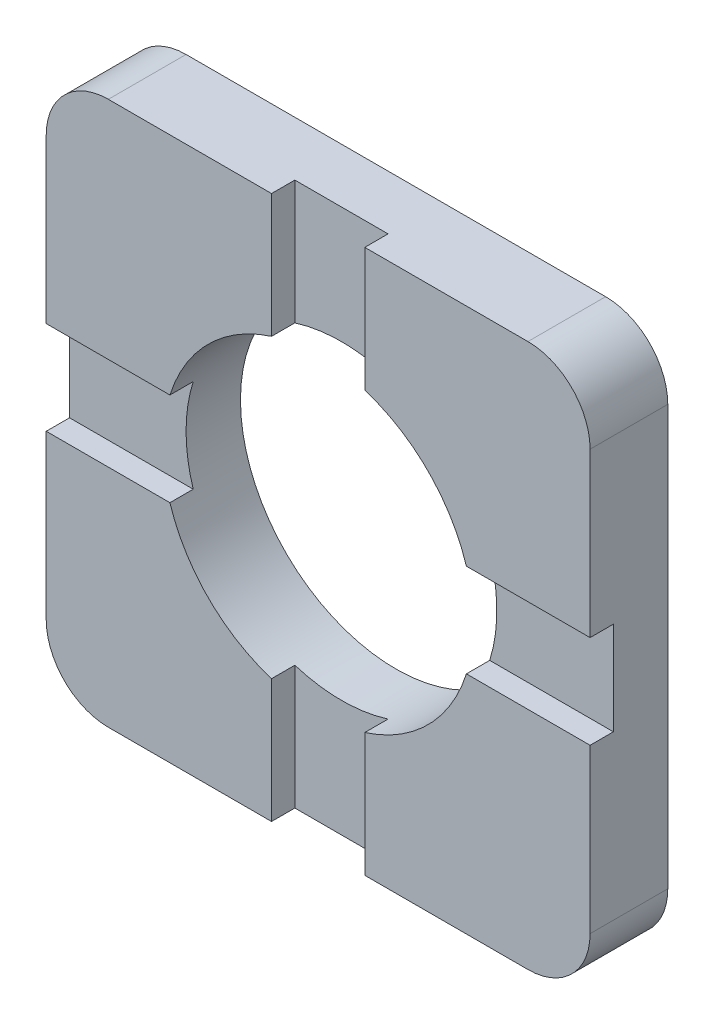
ISO-10303-21;
HEADER;
FILE_DESCRIPTION(('STEP AP214'),'2;1');
FILE_NAME('part.step','',(''),(''),'','','');
FILE_SCHEMA(('AUTOMOTIVE_DESIGN { 1 0 10303 214 1 1 1 1 }'));
ENDSEC;
DATA;
#1=APPLICATION_CONTEXT('core data for automotive mechanical design processes');
#2=APPLICATION_PROTOCOL_DEFINITION('international standard','automotive_design',2000,#1);
#3=PRODUCT_CONTEXT('',#1,'mechanical');
#4=PRODUCT('Part','Part','',(#3));
#5=PRODUCT_RELATED_PRODUCT_CATEGORY('part','',(#4));
#6=PRODUCT_DEFINITION_FORMATION('','',#4);
#7=PRODUCT_DEFINITION_CONTEXT('part definition',#1,'design');
#8=PRODUCT_DEFINITION('design','',#6,#7);
#9=PRODUCT_DEFINITION_SHAPE('','',#8);
#10=(LENGTH_UNIT() NAMED_UNIT(*) SI_UNIT(.MILLI.,.METRE.));
#11=(NAMED_UNIT(*) PLANE_ANGLE_UNIT() SI_UNIT($,.RADIAN.));
#12=(NAMED_UNIT(*) SI_UNIT($,.STERADIAN.) SOLID_ANGLE_UNIT());
#13=UNCERTAINTY_MEASURE_WITH_UNIT(LENGTH_MEASURE(1.E-05),#10,'distance_accuracy_value','');
#14=(GEOMETRIC_REPRESENTATION_CONTEXT(3) GLOBAL_UNCERTAINTY_ASSIGNED_CONTEXT((#13)) GLOBAL_UNIT_ASSIGNED_CONTEXT((#10,
#11,#12)) REPRESENTATION_CONTEXT('',''));
#15=CARTESIAN_POINT('',(0.,0.,0.));
#16=DIRECTION('',(0.,0.,1.));
#17=DIRECTION('',(1.,0.,0.));
#18=AXIS2_PLACEMENT_3D('',#15,#16,#17);
#19=CARTESIAN_POINT('',(0.,0.6,0.7));
#20=DIRECTION('',(0.,1.,0.));
#21=DIRECTION('',(0.,0.,1.));
#22=AXIS2_PLACEMENT_3D('',#19,#20,#21);
#23=PLANE('',#22);
#24=DIRECTION('',(0.,0.,1.));
#25=VECTOR('',#24,1.);
#26=CARTESIAN_POINT('',(-3.5,0.6,0.7));
#27=LINE('',#26,#25);
#28=CARTESIAN_POINT('',(-3.5,0.6,0.7));
#29=VERTEX_POINT('',#28);
#30=CARTESIAN_POINT('',(-3.5,0.6,1.));
#31=VERTEX_POINT('',#30);
#32=EDGE_CURVE('E236',#29,#31,#27,.T.);
#33=ORIENTED_EDGE('',*,*,#32,.F.);
#34=DIRECTION('',(1.,0.,0.));
#35=VECTOR('',#34,1.);
#36=CARTESIAN_POINT('',(0.,0.6,0.7));
#37=LINE('',#36,#35);
#38=CARTESIAN_POINT('',(-1.9078784028339,0.6,0.7));
#39=VERTEX_POINT('',#38);
#40=EDGE_CURVE('E301',#39,#29,#37,.F.);
#41=ORIENTED_EDGE('',*,*,#40,.F.);
#42=DIRECTION('',(0.,0.,1.));
#43=VECTOR('',#42,1.);
#44=CARTESIAN_POINT('',(-1.9078784028339,0.6,0.7));
#45=LINE('',#44,#43);
#46=CARTESIAN_POINT('',(-1.9078784028339,0.6,1.));
#47=VERTEX_POINT('',#46);
#48=EDGE_CURVE('E243',#47,#39,#45,.F.);
#49=ORIENTED_EDGE('',*,*,#48,.F.);
#50=DIRECTION('',(1.,0.,0.));
#51=VECTOR('',#50,1.);
#52=CARTESIAN_POINT('',(-2.7,0.6,1.));
#53=LINE('',#52,#51);
#54=EDGE_CURVE('E351',#31,#47,#53,.T.);
#55=ORIENTED_EDGE('',*,*,#54,.F.);
#56=EDGE_LOOP('',(#33,#41,#49,#55));
#57=FACE_BOUND('',#56,.T.);
#58=ADVANCED_FACE('F17',(#57),#23,.F.);
#59=CARTESIAN_POINT('',(-0.6,0.,0.7));
#60=DIRECTION('',(1.,0.,0.));
#61=DIRECTION('',(0.,0.,-1.));
#62=AXIS2_PLACEMENT_3D('',#59,#60,#61);
#63=PLANE('',#62);
#64=DIRECTION('',(0.,1.,0.));
#65=VECTOR('',#64,1.);
#66=CARTESIAN_POINT('',(-0.6,0.,0.7));
#67=LINE('',#66,#65);
#68=CARTESIAN_POINT('',(-0.6,3.5,0.7));
#69=VERTEX_POINT('',#68);
#70=CARTESIAN_POINT('',(-0.6,1.90787840283389,0.7));
#71=VERTEX_POINT('',#70);
#72=EDGE_CURVE('E356',#69,#71,#67,.F.);
#73=ORIENTED_EDGE('',*,*,#72,.F.);
#74=DIRECTION('',(0.,0.,-1.));
#75=VECTOR('',#74,1.);
#76=CARTESIAN_POINT('',(-0.6,3.5,0.7));
#77=LINE('',#76,#75);
#78=CARTESIAN_POINT('',(-0.6,3.5,1.));
#79=VERTEX_POINT('',#78);
#80=EDGE_CURVE('E224',#69,#79,#77,.F.);
#81=ORIENTED_EDGE('',*,*,#80,.T.);
#82=DIRECTION('',(0.,1.,0.));
#83=VECTOR('',#82,1.);
#84=CARTESIAN_POINT('',(-0.6,-2.7,1.));
#85=LINE('',#84,#83);
#86=CARTESIAN_POINT('',(-0.6,1.90787840283389,1.));
#87=VERTEX_POINT('',#86);
#88=EDGE_CURVE('E337',#87,#79,#85,.T.);
#89=ORIENTED_EDGE('',*,*,#88,.F.);
#90=DIRECTION('',(0.,0.,-1.));
#91=VECTOR('',#90,1.);
#92=CARTESIAN_POINT('',(-0.6,1.90787840283389,0.7));
#93=LINE('',#92,#91);
#94=EDGE_CURVE('E234',#87,#71,#93,.T.);
#95=ORIENTED_EDGE('',*,*,#94,.T.);
#96=EDGE_LOOP('',(#73,#81,#89,#95));
#97=FACE_BOUND('',#96,.T.);
#98=ADVANCED_FACE('F681',(#97),#63,.T.);
#99=CARTESIAN_POINT('',(0.,0.6,0.7));
#100=DIRECTION('',(0.,1.,0.));
#101=DIRECTION('',(0.,0.,1.));
#102=AXIS2_PLACEMENT_3D('',#99,#100,#101);
#103=PLANE('',#102);
#104=DIRECTION('',(0.,0.,1.));
#105=VECTOR('',#104,1.);
#106=CARTESIAN_POINT('',(1.90787840283389,0.6,0.7));
#107=LINE('',#106,#105);
#108=CARTESIAN_POINT('',(1.90787840283389,0.6,0.7));
#109=VERTEX_POINT('',#108);
#110=CARTESIAN_POINT('',(1.90787840283389,0.6,1.));
#111=VERTEX_POINT('',#110);
#112=EDGE_CURVE('E147',#109,#111,#107,.T.);
#113=ORIENTED_EDGE('',*,*,#112,.F.);
#114=DIRECTION('',(1.,0.,0.));
#115=VECTOR('',#114,1.);
#116=CARTESIAN_POINT('',(0.,0.6,0.7));
#117=LINE('',#116,#115);
#118=CARTESIAN_POINT('',(3.5,0.6,0.7));
#119=VERTEX_POINT('',#118);
#120=EDGE_CURVE('E153',#119,#109,#117,.F.);
#121=ORIENTED_EDGE('',*,*,#120,.F.);
#122=DIRECTION('',(0.,0.,1.));
#123=VECTOR('',#122,1.);
#124=CARTESIAN_POINT('',(3.5,0.6,0.7));
#125=LINE('',#124,#123);
#126=CARTESIAN_POINT('',(3.5,0.6,1.));
#127=VERTEX_POINT('',#126);
#128=EDGE_CURVE('E164',#127,#119,#125,.F.);
#129=ORIENTED_EDGE('',*,*,#128,.F.);
#130=DIRECTION('',(1.,0.,0.));
#131=VECTOR('',#130,1.);
#132=CARTESIAN_POINT('',(-2.7,0.6,1.));
#133=LINE('',#132,#131);
#134=EDGE_CURVE('E161',#111,#127,#133,.T.);
#135=ORIENTED_EDGE('',*,*,#134,.F.);
#136=EDGE_LOOP('',(#113,#121,#129,#135));
#137=FACE_BOUND('',#136,.T.);
#138=ADVANCED_FACE('F156',(#137),#103,.F.);
#139=CARTESIAN_POINT('',(0.6,0.,0.7));
#140=DIRECTION('',(1.,0.,0.));
#141=DIRECTION('',(0.,0.,-1.));
#142=AXIS2_PLACEMENT_3D('',#139,#140,#141);
#143=PLANE('',#142);
#144=DIRECTION('',(0.,0.,-1.));
#145=VECTOR('',#144,1.);
#146=CARTESIAN_POINT('',(0.6,3.5,0.7));
#147=LINE('',#146,#145);
#148=CARTESIAN_POINT('',(0.6,3.5,0.7));
#149=VERTEX_POINT('',#148);
#150=CARTESIAN_POINT('',(0.6,3.5,1.));
#151=VERTEX_POINT('',#150);
#152=EDGE_CURVE('E213',#149,#151,#147,.F.);
#153=ORIENTED_EDGE('',*,*,#152,.F.);
#154=DIRECTION('',(0.,1.,0.));
#155=VECTOR('',#154,1.);
#156=CARTESIAN_POINT('',(0.6,0.,0.7));
#157=LINE('',#156,#155);
#158=CARTESIAN_POINT('',(0.6,1.90787840283389,0.7));
#159=VERTEX_POINT('',#158);
#160=EDGE_CURVE('E361',#159,#149,#157,.T.);
#161=ORIENTED_EDGE('',*,*,#160,.F.);
#162=DIRECTION('',(0.,0.,-1.));
#163=VECTOR('',#162,1.);
#164=CARTESIAN_POINT('',(0.6,1.90787840283389,0.7));
#165=LINE('',#164,#163);
#166=CARTESIAN_POINT('',(0.6,1.90787840283389,1.));
#167=VERTEX_POINT('',#166);
#168=EDGE_CURVE('E163',#167,#159,#165,.T.);
#169=ORIENTED_EDGE('',*,*,#168,.F.);
#170=DIRECTION('',(0.,1.,0.));
#171=VECTOR('',#170,1.);
#172=CARTESIAN_POINT('',(0.6,-2.7,1.));
#173=LINE('',#172,#171);
#174=EDGE_CURVE('E369',#151,#167,#173,.F.);
#175=ORIENTED_EDGE('',*,*,#174,.F.);
#176=EDGE_LOOP('',(#153,#161,#169,#175));
#177=FACE_BOUND('',#176,.T.);
#178=ADVANCED_FACE('F662',(#177),#143,.F.);
#179=CARTESIAN_POINT('',(0.,-0.6,0.7));
#180=DIRECTION('',(0.,1.,0.));
#181=DIRECTION('',(0.,0.,1.));
#182=AXIS2_PLACEMENT_3D('',#179,#180,#181);
#183=PLANE('',#182);
#184=DIRECTION('',(1.,0.,0.));
#185=VECTOR('',#184,1.);
#186=CARTESIAN_POINT('',(0.,-0.6,0.7));
#187=LINE('',#186,#185);
#188=CARTESIAN_POINT('',(1.90787840283389,-0.6,0.7));
#189=VERTEX_POINT('',#188);
#190=CARTESIAN_POINT('',(3.5,-0.6,0.7));
#191=VERTEX_POINT('',#190);
#192=EDGE_CURVE('E152',#189,#191,#187,.T.);
#193=ORIENTED_EDGE('',*,*,#192,.F.);
#194=DIRECTION('',(0.,0.,1.));
#195=VECTOR('',#194,1.);
#196=CARTESIAN_POINT('',(1.90787840283389,-0.6,0.7));
#197=LINE('',#196,#195);
#198=CARTESIAN_POINT('',(1.90787840283389,-0.6,1.));
#199=VERTEX_POINT('',#198);
#200=EDGE_CURVE('E150',#189,#199,#197,.T.);
#201=ORIENTED_EDGE('',*,*,#200,.T.);
#202=DIRECTION('',(1.,0.,0.));
#203=VECTOR('',#202,1.);
#204=CARTESIAN_POINT('',(-2.7,-0.6,1.));
#205=LINE('',#204,#203);
#206=CARTESIAN_POINT('',(3.5,-0.6,1.));
#207=VERTEX_POINT('',#206);
#208=EDGE_CURVE('E374',#207,#199,#205,.F.);
#209=ORIENTED_EDGE('',*,*,#208,.F.);
#210=DIRECTION('',(0.,0.,1.));
#211=VECTOR('',#210,1.);
#212=CARTESIAN_POINT('',(3.5,-0.6,0.7));
#213=LINE('',#212,#211);
#214=EDGE_CURVE('E210',#207,#191,#213,.F.);
#215=ORIENTED_EDGE('',*,*,#214,.T.);
#216=EDGE_LOOP('',(#193,#201,#209,#215));
#217=FACE_BOUND('',#216,.T.);
#218=ADVANCED_FACE('F652',(#217),#183,.T.);
#219=CARTESIAN_POINT('',(0.6,0.,0.7));
#220=DIRECTION('',(1.,0.,0.));
#221=DIRECTION('',(0.,0.,-1.));
#222=AXIS2_PLACEMENT_3D('',#219,#220,#221);
#223=PLANE('',#222);
#224=DIRECTION('',(0.,0.,-1.));
#225=VECTOR('',#224,1.);
#226=CARTESIAN_POINT('',(0.6,-1.90787840283389,0.7));
#227=LINE('',#226,#225);
#228=CARTESIAN_POINT('',(0.6,-1.90787840283389,0.7));
#229=VERTEX_POINT('',#228);
#230=CARTESIAN_POINT('',(0.6,-1.90787840283389,1.));
#231=VERTEX_POINT('',#230);
#232=EDGE_CURVE('E195',#229,#231,#227,.F.);
#233=ORIENTED_EDGE('',*,*,#232,.F.);
#234=DIRECTION('',(0.,1.,0.));
#235=VECTOR('',#234,1.);
#236=CARTESIAN_POINT('',(0.6,0.,0.7));
#237=LINE('',#236,#235);
#238=CARTESIAN_POINT('',(0.6,-3.5,0.7));
#239=VERTEX_POINT('',#238);
#240=EDGE_CURVE('E389',#239,#229,#237,.T.);
#241=ORIENTED_EDGE('',*,*,#240,.F.);
#242=DIRECTION('',(0.,0.,-1.));
#243=VECTOR('',#242,1.);
#244=CARTESIAN_POINT('',(0.6,-3.5,0.7));
#245=LINE('',#244,#243);
#246=CARTESIAN_POINT('',(0.6,-3.5,1.));
#247=VERTEX_POINT('',#246);
#248=EDGE_CURVE('E200',#247,#239,#245,.T.);
#249=ORIENTED_EDGE('',*,*,#248,.F.);
#250=DIRECTION('',(0.,1.,0.));
#251=VECTOR('',#250,1.);
#252=CARTESIAN_POINT('',(0.6,-2.7,1.));
#253=LINE('',#252,#251);
#254=EDGE_CURVE('E379',#231,#247,#253,.F.);
#255=ORIENTED_EDGE('',*,*,#254,.F.);
#256=EDGE_LOOP('',(#233,#241,#249,#255));
#257=FACE_BOUND('',#256,.T.);
#258=ADVANCED_FACE('F642',(#257),#223,.F.);
#259=CARTESIAN_POINT('',(-0.6,0.,0.7));
#260=DIRECTION('',(1.,0.,0.));
#261=DIRECTION('',(0.,0.,-1.));
#262=AXIS2_PLACEMENT_3D('',#259,#260,#261);
#263=PLANE('',#262);
#264=DIRECTION('',(0.,1.,0.));
#265=VECTOR('',#264,1.);
#266=CARTESIAN_POINT('',(-0.6,0.,0.7));
#267=LINE('',#266,#265);
#268=CARTESIAN_POINT('',(-0.6,-1.90787840283389,0.7));
#269=VERTEX_POINT('',#268);
#270=CARTESIAN_POINT('',(-0.6,-3.5,0.7));
#271=VERTEX_POINT('',#270);
#272=EDGE_CURVE('E384',#269,#271,#267,.F.);
#273=ORIENTED_EDGE('',*,*,#272,.F.);
#274=DIRECTION('',(0.,0.,-1.));
#275=VECTOR('',#274,1.);
#276=CARTESIAN_POINT('',(-0.6,-1.90787840283389,0.7));
#277=LINE('',#276,#275);
#278=CARTESIAN_POINT('',(-0.6,-1.90787840283389,1.));
#279=VERTEX_POINT('',#278);
#280=EDGE_CURVE('E188',#269,#279,#277,.F.);
#281=ORIENTED_EDGE('',*,*,#280,.T.);
#282=DIRECTION('',(0.,1.,0.));
#283=VECTOR('',#282,1.);
#284=CARTESIAN_POINT('',(-0.6,-2.7,1.));
#285=LINE('',#284,#283);
#286=CARTESIAN_POINT('',(-0.6,-3.5,1.));
#287=VERTEX_POINT('',#286);
#288=EDGE_CURVE('E394',#287,#279,#285,.T.);
#289=ORIENTED_EDGE('',*,*,#288,.F.);
#290=DIRECTION('',(0.,0.,-1.));
#291=VECTOR('',#290,1.);
#292=CARTESIAN_POINT('',(-0.6,-3.5,0.7));
#293=LINE('',#292,#291);
#294=EDGE_CURVE('E192',#287,#271,#293,.T.);
#295=ORIENTED_EDGE('',*,*,#294,.T.);
#296=EDGE_LOOP('',(#273,#281,#289,#295));
#297=FACE_BOUND('',#296,.T.);
#298=ADVANCED_FACE('F632',(#297),#263,.T.);
#299=CARTESIAN_POINT('',(0.,-0.6,0.7));
#300=DIRECTION('',(0.,1.,0.));
#301=DIRECTION('',(0.,0.,1.));
#302=AXIS2_PLACEMENT_3D('',#299,#300,#301);
#303=PLANE('',#302);
#304=DIRECTION('',(1.,0.,0.));
#305=VECTOR('',#304,1.);
#306=CARTESIAN_POINT('',(0.,-0.6,0.7));
#307=LINE('',#306,#305);
#308=CARTESIAN_POINT('',(-3.5,-0.6,0.7));
#309=VERTEX_POINT('',#308);
#310=CARTESIAN_POINT('',(-1.90787840283389,-0.6,0.7));
#311=VERTEX_POINT('',#310);
#312=EDGE_CURVE('E305',#309,#311,#307,.T.);
#313=ORIENTED_EDGE('',*,*,#312,.F.);
#314=DIRECTION('',(0.,0.,1.));
#315=VECTOR('',#314,1.);
#316=CARTESIAN_POINT('',(-3.5,-0.6,0.7));
#317=LINE('',#316,#315);
#318=CARTESIAN_POINT('',(-3.5,-0.6,1.));
#319=VERTEX_POINT('',#318);
#320=EDGE_CURVE('E169',#309,#319,#317,.T.);
#321=ORIENTED_EDGE('',*,*,#320,.T.);
#322=DIRECTION('',(1.,0.,0.));
#323=VECTOR('',#322,1.);
#324=CARTESIAN_POINT('',(-2.7,-0.6,1.));
#325=LINE('',#324,#323);
#326=CARTESIAN_POINT('',(-1.90787840283389,-0.6,1.));
#327=VERTEX_POINT('',#326);
#328=EDGE_CURVE('E207',#327,#319,#325,.F.);
#329=ORIENTED_EDGE('',*,*,#328,.F.);
#330=DIRECTION('',(0.,0.,1.));
#331=VECTOR('',#330,1.);
#332=CARTESIAN_POINT('',(-1.90787840283389,-0.6,0.7));
#333=LINE('',#332,#331);
#334=EDGE_CURVE('E172',#327,#311,#333,.F.);
#335=ORIENTED_EDGE('',*,*,#334,.T.);
#336=EDGE_LOOP('',(#313,#321,#329,#335));
#337=FACE_BOUND('',#336,.T.);
#338=ADVANCED_FACE('F623',(#337),#303,.T.);
#339=CARTESIAN_POINT('',(0.,0.,0.7));
#340=DIRECTION('',(0.,0.,1.));
#341=DIRECTION('',(1.,0.,0.));
#342=AXIS2_PLACEMENT_3D('',#339,#340,#341);
#343=PLANE('',#342);
#344=CARTESIAN_POINT('',(0.,0.,0.7));
#345=DIRECTION('',(0.,0.,-1.));
#346=DIRECTION('',(-1.,0.,0.));
#347=AXIS2_PLACEMENT_3D('',#344,#345,#346);
#348=CIRCLE('',#347,2.);
#349=EDGE_CURVE('E20',#109,#189,#348,.T.);
#350=ORIENTED_EDGE('',*,*,#349,.T.);
#351=ORIENTED_EDGE('',*,*,#192,.T.);
#352=DIRECTION('',(0.,-1.,0.));
#353=VECTOR('',#352,1.);
#354=CARTESIAN_POINT('',(3.5,2.7,0.7));
#355=LINE('',#354,#353);
#356=EDGE_CURVE('E168',#191,#119,#355,.F.);
#357=ORIENTED_EDGE('',*,*,#356,.T.);
#358=ORIENTED_EDGE('',*,*,#120,.T.);
#359=EDGE_LOOP('',(#350,#351,#357,#358));
#360=FACE_BOUND('',#359,.T.);
#361=ADVANCED_FACE('F166',(#360),#343,.T.);
#362=CARTESIAN_POINT('',(0.,0.,0.7));
#363=DIRECTION('',(0.,0.,1.));
#364=DIRECTION('',(1.,0.,0.));
#365=AXIS2_PLACEMENT_3D('',#362,#363,#364);
#366=PLANE('',#365);
#367=DIRECTION('',(0.,1.,0.));
#368=VECTOR('',#367,1.);
#369=CARTESIAN_POINT('',(-3.5,2.7,0.7));
#370=LINE('',#369,#368);
#371=EDGE_CURVE('E248',#29,#309,#370,.F.);
#372=ORIENTED_EDGE('',*,*,#371,.T.);
#373=ORIENTED_EDGE('',*,*,#312,.T.);
#374=CARTESIAN_POINT('',(0.,0.,0.7));
#375=DIRECTION('',(0.,0.,-1.));
#376=DIRECTION('',(-1.,0.,0.));
#377=AXIS2_PLACEMENT_3D('',#374,#375,#376);
#378=CIRCLE('',#377,2.);
#379=EDGE_CURVE('E300',#311,#39,#378,.T.);
#380=ORIENTED_EDGE('',*,*,#379,.T.);
#381=ORIENTED_EDGE('',*,*,#40,.T.);
#382=EDGE_LOOP('',(#372,#373,#380,#381));
#383=FACE_BOUND('',#382,.T.);
#384=ADVANCED_FACE('F605',(#383),#366,.T.);
#385=CARTESIAN_POINT('',(-2.7,-2.7,1.));
#386=DIRECTION('',(0.,0.,1.));
#387=DIRECTION('',(1.,0.,0.));
#388=AXIS2_PLACEMENT_3D('',#385,#386,#387);
#389=PLANE('',#388);
#390=DIRECTION('',(0.,1.,0.));
#391=VECTOR('',#390,1.);
#392=CARTESIAN_POINT('',(-3.5,2.7,1.));
#393=LINE('',#392,#391);
#394=CARTESIAN_POINT('',(-3.5,2.7,1.));
#395=VERTEX_POINT('',#394);
#396=EDGE_CURVE('E252',#395,#31,#393,.F.);
#397=ORIENTED_EDGE('',*,*,#396,.T.);
#398=ORIENTED_EDGE('',*,*,#54,.T.);
#399=CARTESIAN_POINT('',(0.,0.,1.));
#400=DIRECTION('',(0.,0.,-1.));
#401=DIRECTION('',(-1.,0.,0.));
#402=AXIS2_PLACEMENT_3D('',#399,#400,#401);
#403=CIRCLE('',#402,2.);
#404=EDGE_CURVE('E288',#47,#87,#403,.T.);
#405=ORIENTED_EDGE('',*,*,#404,.T.);
#406=ORIENTED_EDGE('',*,*,#88,.T.);
#407=DIRECTION('',(1.,0.,0.));
#408=VECTOR('',#407,1.);
#409=CARTESIAN_POINT('',(-2.7,3.5,1.));
#410=LINE('',#409,#408);
#411=CARTESIAN_POINT('',(-2.7,3.5,1.));
#412=VERTEX_POINT('',#411);
#413=EDGE_CURVE('E324',#79,#412,#410,.F.);
#414=ORIENTED_EDGE('',*,*,#413,.T.);
#415=CARTESIAN_POINT('',(-2.7,2.7,1.));
#416=DIRECTION('',(0.,0.,-1.));
#417=DIRECTION('',(-1.,0.,0.));
#418=AXIS2_PLACEMENT_3D('',#415,#416,#417);
#419=CIRCLE('',#418,0.8);
#420=EDGE_CURVE('E230',#395,#412,#419,.T.);
#421=ORIENTED_EDGE('',*,*,#420,.F.);
#422=EDGE_LOOP('',(#397,#398,#405,#406,#414,#421));
#423=FACE_BOUND('',#422,.T.);
#424=ADVANCED_FACE('F595',(#423),#389,.T.);
#425=CARTESIAN_POINT('',(0.,0.,0.7));
#426=DIRECTION('',(0.,0.,1.));
#427=DIRECTION('',(1.,0.,0.));
#428=AXIS2_PLACEMENT_3D('',#425,#426,#427);
#429=PLANE('',#428);
#430=ORIENTED_EDGE('',*,*,#160,.T.);
#431=DIRECTION('',(1.,0.,0.));
#432=VECTOR('',#431,1.);
#433=CARTESIAN_POINT('',(-2.7,3.5,0.7));
#434=LINE('',#433,#432);
#435=EDGE_CURVE('E227',#149,#69,#434,.F.);
#436=ORIENTED_EDGE('',*,*,#435,.T.);
#437=ORIENTED_EDGE('',*,*,#72,.T.);
#438=CARTESIAN_POINT('',(0.,0.,0.7));
#439=DIRECTION('',(0.,0.,-1.));
#440=DIRECTION('',(-1.,0.,0.));
#441=AXIS2_PLACEMENT_3D('',#438,#439,#440);
#442=CIRCLE('',#441,2.);
#443=EDGE_CURVE('E285',#71,#159,#442,.T.);
#444=ORIENTED_EDGE('',*,*,#443,.T.);
#445=EDGE_LOOP('',(#430,#436,#437,#444));
#446=FACE_BOUND('',#445,.T.);
#447=ADVANCED_FACE('F585',(#446),#429,.T.);
#448=CARTESIAN_POINT('',(-2.7,-2.7,1.));
#449=DIRECTION('',(0.,0.,1.));
#450=DIRECTION('',(1.,0.,0.));
#451=AXIS2_PLACEMENT_3D('',#448,#449,#450);
#452=PLANE('',#451);
#453=ORIENTED_EDGE('',*,*,#174,.T.);
#454=CARTESIAN_POINT('',(0.,0.,1.));
#455=DIRECTION('',(0.,0.,-1.));
#456=DIRECTION('',(-1.,0.,0.));
#457=AXIS2_PLACEMENT_3D('',#454,#455,#456);
#458=CIRCLE('',#457,2.);
#459=EDGE_CURVE('E283',#167,#111,#458,.T.);
#460=ORIENTED_EDGE('',*,*,#459,.T.);
#461=ORIENTED_EDGE('',*,*,#134,.T.);
#462=DIRECTION('',(0.,-1.,0.));
#463=VECTOR('',#462,1.);
#464=CARTESIAN_POINT('',(3.5,2.7,1.));
#465=LINE('',#464,#463);
#466=CARTESIAN_POINT('',(3.5,2.7,1.));
#467=VERTEX_POINT('',#466);
#468=EDGE_CURVE('E256',#127,#467,#465,.F.);
#469=ORIENTED_EDGE('',*,*,#468,.T.);
#470=CARTESIAN_POINT('',(2.7,2.7,1.));
#471=DIRECTION('',(0.,0.,-1.));
#472=DIRECTION('',(-1.,0.,0.));
#473=AXIS2_PLACEMENT_3D('',#470,#471,#472);
#474=CIRCLE('',#473,0.8);
#475=CARTESIAN_POINT('',(2.7,3.5,1.));
#476=VERTEX_POINT('',#475);
#477=EDGE_CURVE('E295',#476,#467,#474,.T.);
#478=ORIENTED_EDGE('',*,*,#477,.F.);
#479=DIRECTION('',(1.,0.,0.));
#480=VECTOR('',#479,1.);
#481=CARTESIAN_POINT('',(-2.7,3.5,1.));
#482=LINE('',#481,#480);
#483=EDGE_CURVE('E231',#476,#151,#482,.F.);
#484=ORIENTED_EDGE('',*,*,#483,.T.);
#485=EDGE_LOOP('',(#453,#460,#461,#469,#478,#484));
#486=FACE_BOUND('',#485,.T.);
#487=ADVANCED_FACE('F575',(#486),#452,.T.);
#488=CARTESIAN_POINT('',(-2.7,-2.7,1.));
#489=DIRECTION('',(0.,0.,1.));
#490=DIRECTION('',(1.,0.,0.));
#491=AXIS2_PLACEMENT_3D('',#488,#489,#490);
#492=PLANE('',#491);
#493=DIRECTION('',(-1.,0.,0.));
#494=VECTOR('',#493,1.);
#495=CARTESIAN_POINT('',(-2.7,-3.5,1.));
#496=LINE('',#495,#494);
#497=CARTESIAN_POINT('',(2.7,-3.5,1.));
#498=VERTEX_POINT('',#497);
#499=EDGE_CURVE('E180',#247,#498,#496,.F.);
#500=ORIENTED_EDGE('',*,*,#499,.T.);
#501=CARTESIAN_POINT('',(2.7,-2.7,1.));
#502=DIRECTION('',(0.,0.,-1.));
#503=DIRECTION('',(-1.,0.,0.));
#504=AXIS2_PLACEMENT_3D('',#501,#502,#503);
#505=CIRCLE('',#504,0.799999999999999);
#506=CARTESIAN_POINT('',(3.5,-2.7,1.));
#507=VERTEX_POINT('',#506);
#508=EDGE_CURVE('E299',#507,#498,#505,.T.);
#509=ORIENTED_EDGE('',*,*,#508,.F.);
#510=DIRECTION('',(0.,-1.,0.));
#511=VECTOR('',#510,1.);
#512=CARTESIAN_POINT('',(3.5,2.7,1.));
#513=LINE('',#512,#511);
#514=EDGE_CURVE('E298',#507,#207,#513,.F.);
#515=ORIENTED_EDGE('',*,*,#514,.T.);
#516=ORIENTED_EDGE('',*,*,#208,.T.);
#517=CARTESIAN_POINT('',(0.,0.,1.));
#518=DIRECTION('',(0.,0.,-1.));
#519=DIRECTION('',(-1.,0.,0.));
#520=AXIS2_PLACEMENT_3D('',#517,#518,#519);
#521=CIRCLE('',#520,2.);
#522=EDGE_CURVE('E280',#199,#231,#521,.T.);
#523=ORIENTED_EDGE('',*,*,#522,.T.);
#524=ORIENTED_EDGE('',*,*,#254,.T.);
#525=EDGE_LOOP('',(#500,#509,#515,#516,#523,#524));
#526=FACE_BOUND('',#525,.T.);
#527=ADVANCED_FACE('F565',(#526),#492,.T.);
#528=CARTESIAN_POINT('',(0.,0.,0.7));
#529=DIRECTION('',(0.,0.,1.));
#530=DIRECTION('',(1.,0.,0.));
#531=AXIS2_PLACEMENT_3D('',#528,#529,#530);
#532=PLANE('',#531);
#533=ORIENTED_EDGE('',*,*,#240,.T.);
#534=CARTESIAN_POINT('',(0.,0.,0.7));
#535=DIRECTION('',(0.,0.,-1.));
#536=DIRECTION('',(-1.,0.,0.));
#537=AXIS2_PLACEMENT_3D('',#534,#535,#536);
#538=CIRCLE('',#537,2.);
#539=EDGE_CURVE('E277',#229,#269,#538,.T.);
#540=ORIENTED_EDGE('',*,*,#539,.T.);
#541=ORIENTED_EDGE('',*,*,#272,.T.);
#542=DIRECTION('',(-1.,0.,0.));
#543=VECTOR('',#542,1.);
#544=CARTESIAN_POINT('',(-2.7,-3.5,0.7));
#545=LINE('',#544,#543);
#546=EDGE_CURVE('E184',#271,#239,#545,.F.);
#547=ORIENTED_EDGE('',*,*,#546,.T.);
#548=EDGE_LOOP('',(#533,#540,#541,#547));
#549=FACE_BOUND('',#548,.T.);
#550=ADVANCED_FACE('F555',(#549),#532,.T.);
#551=CARTESIAN_POINT('',(-2.7,-2.7,1.));
#552=DIRECTION('',(0.,0.,1.));
#553=DIRECTION('',(1.,0.,0.));
#554=AXIS2_PLACEMENT_3D('',#551,#552,#553);
#555=PLANE('',#554);
#556=DIRECTION('',(0.,1.,0.));
#557=VECTOR('',#556,1.);
#558=CARTESIAN_POINT('',(-3.5,2.7,1.));
#559=LINE('',#558,#557);
#560=CARTESIAN_POINT('',(-3.5,-2.7,1.));
#561=VERTEX_POINT('',#560);
#562=EDGE_CURVE('E344',#319,#561,#559,.F.);
#563=ORIENTED_EDGE('',*,*,#562,.T.);
#564=CARTESIAN_POINT('',(-2.7,-2.7,1.));
#565=DIRECTION('',(0.,0.,-1.));
#566=DIRECTION('',(-1.,0.,0.));
#567=AXIS2_PLACEMENT_3D('',#564,#565,#566);
#568=CIRCLE('',#567,0.8);
#569=CARTESIAN_POINT('',(-2.7,-3.5,1.));
#570=VERTEX_POINT('',#569);
#571=EDGE_CURVE('E291',#570,#561,#568,.T.);
#572=ORIENTED_EDGE('',*,*,#571,.F.);
#573=DIRECTION('',(-1.,0.,0.));
#574=VECTOR('',#573,1.);
#575=CARTESIAN_POINT('',(-2.7,-3.5,1.));
#576=LINE('',#575,#574);
#577=EDGE_CURVE('E183',#570,#287,#576,.F.);
#578=ORIENTED_EDGE('',*,*,#577,.T.);
#579=ORIENTED_EDGE('',*,*,#288,.T.);
#580=CARTESIAN_POINT('',(0.,0.,1.));
#581=DIRECTION('',(0.,0.,-1.));
#582=DIRECTION('',(-1.,0.,0.));
#583=AXIS2_PLACEMENT_3D('',#580,#581,#582);
#584=CIRCLE('',#583,2.);
#585=EDGE_CURVE('E274',#279,#327,#584,.T.);
#586=ORIENTED_EDGE('',*,*,#585,.T.);
#587=ORIENTED_EDGE('',*,*,#328,.T.);
#588=EDGE_LOOP('',(#563,#572,#578,#579,#586,#587));
#589=FACE_BOUND('',#588,.T.);
#590=ADVANCED_FACE('F546',(#589),#555,.T.);
#591=CARTESIAN_POINT('',(-2.7,-3.5,1.));
#592=DIRECTION('',(0.,1.,0.));
#593=DIRECTION('',(-1.,0.,0.));
#594=AXIS2_PLACEMENT_3D('',#591,#592,#593);
#595=PLANE('',#594);
#596=ORIENTED_EDGE('',*,*,#577,.F.);
#597=DIRECTION('',(0.,0.,-1.));
#598=VECTOR('',#597,1.);
#599=CARTESIAN_POINT('',(-2.7,-3.5,1.));
#600=LINE('',#599,#598);
#601=CARTESIAN_POINT('',(-2.7,-3.5,0.));
#602=VERTEX_POINT('',#601);
#603=EDGE_CURVE('E251',#602,#570,#600,.F.);
#604=ORIENTED_EDGE('',*,*,#603,.F.);
#605=DIRECTION('',(1.,0.,0.));
#606=VECTOR('',#605,1.);
#607=CARTESIAN_POINT('',(-2.7,-3.5,0.));
#608=LINE('',#607,#606);
#609=CARTESIAN_POINT('',(2.7,-3.5,0.));
#610=VERTEX_POINT('',#609);
#611=EDGE_CURVE('E273',#602,#610,#608,.T.);
#612=ORIENTED_EDGE('',*,*,#611,.T.);
#613=DIRECTION('',(0.,0.,-1.));
#614=VECTOR('',#613,1.);
#615=CARTESIAN_POINT('',(2.7,-3.5,1.));
#616=LINE('',#615,#614);
#617=EDGE_CURVE('E257',#498,#610,#616,.T.);
#618=ORIENTED_EDGE('',*,*,#617,.F.);
#619=ORIENTED_EDGE('',*,*,#499,.F.);
#620=ORIENTED_EDGE('',*,*,#248,.T.);
#621=ORIENTED_EDGE('',*,*,#546,.F.);
#622=ORIENTED_EDGE('',*,*,#294,.F.);
#623=EDGE_LOOP('',(#596,#604,#612,#618,#619,#620,#621,#622));
#624=FACE_BOUND('',#623,.T.);
#625=ADVANCED_FACE('F456',(#624),#595,.F.);
#626=CARTESIAN_POINT('',(2.7,-2.7,1.));
#627=DIRECTION('',(0.,0.,-1.));
#628=DIRECTION('',(-1.,0.,0.));
#629=AXIS2_PLACEMENT_3D('',#626,#627,#628);
#630=CYLINDRICAL_SURFACE('',#629,0.799999999999999);
#631=ORIENTED_EDGE('',*,*,#508,.T.);
#632=ORIENTED_EDGE('',*,*,#617,.T.);
#633=CARTESIAN_POINT('',(2.7,-2.7,0.));
#634=DIRECTION('',(0.,0.,-1.));
#635=DIRECTION('',(-1.,0.,0.));
#636=AXIS2_PLACEMENT_3D('',#633,#634,#635);
#637=CIRCLE('',#636,0.799999999999999);
#638=CARTESIAN_POINT('',(3.5,-2.7,0.));
#639=VERTEX_POINT('',#638);
#640=EDGE_CURVE('E270',#610,#639,#637,.F.);
#641=ORIENTED_EDGE('',*,*,#640,.T.);
#642=DIRECTION('',(0.,0.,1.));
#643=VECTOR('',#642,1.);
#644=CARTESIAN_POINT('',(3.5,-2.7,1.));
#645=LINE('',#644,#643);
#646=EDGE_CURVE('E312',#639,#507,#645,.T.);
#647=ORIENTED_EDGE('',*,*,#646,.T.);
#648=EDGE_LOOP('',(#631,#632,#641,#647));
#649=FACE_BOUND('',#648,.T.);
#650=ADVANCED_FACE('F452',(#649),#630,.T.);
#651=CARTESIAN_POINT('',(3.5,2.7,1.));
#652=DIRECTION('',(-1.,0.,0.));
#653=DIRECTION('',(0.,-1.,0.));
#654=AXIS2_PLACEMENT_3D('',#651,#652,#653);
#655=PLANE('',#654);
#656=ORIENTED_EDGE('',*,*,#514,.F.);
#657=ORIENTED_EDGE('',*,*,#646,.F.);
#658=DIRECTION('',(0.,1.,0.));
#659=VECTOR('',#658,1.);
#660=CARTESIAN_POINT('',(3.5,-2.7,0.));
#661=LINE('',#660,#659);
#662=CARTESIAN_POINT('',(3.5,2.7,0.));
#663=VERTEX_POINT('',#662);
#664=EDGE_CURVE('E269',#639,#663,#661,.T.);
#665=ORIENTED_EDGE('',*,*,#664,.T.);
#666=DIRECTION('',(0.,0.,-1.));
#667=VECTOR('',#666,1.);
#668=CARTESIAN_POINT('',(3.5,2.7,1.));
#669=LINE('',#668,#667);
#670=EDGE_CURVE('E297',#467,#663,#669,.T.);
#671=ORIENTED_EDGE('',*,*,#670,.F.);
#672=ORIENTED_EDGE('',*,*,#468,.F.);
#673=ORIENTED_EDGE('',*,*,#128,.T.);
#674=ORIENTED_EDGE('',*,*,#356,.F.);
#675=ORIENTED_EDGE('',*,*,#214,.F.);
#676=EDGE_LOOP('',(#656,#657,#665,#671,#672,#673,#674,#675));
#677=FACE_BOUND('',#676,.T.);
#678=ADVANCED_FACE('F449',(#677),#655,.F.);
#679=CARTESIAN_POINT('',(2.7,2.7,1.));
#680=DIRECTION('',(0.,0.,-1.));
#681=DIRECTION('',(-1.,0.,0.));
#682=AXIS2_PLACEMENT_3D('',#679,#680,#681);
#683=CYLINDRICAL_SURFACE('',#682,0.8);
#684=ORIENTED_EDGE('',*,*,#477,.T.);
#685=ORIENTED_EDGE('',*,*,#670,.T.);
#686=CARTESIAN_POINT('',(2.7,2.7,0.));
#687=DIRECTION('',(0.,0.,-1.));
#688=DIRECTION('',(-1.,0.,0.));
#689=AXIS2_PLACEMENT_3D('',#686,#687,#688);
#690=CIRCLE('',#689,0.8);
#691=CARTESIAN_POINT('',(2.7,3.5,0.));
#692=VERTEX_POINT('',#691);
#693=EDGE_CURVE('E266',#663,#692,#690,.F.);
#694=ORIENTED_EDGE('',*,*,#693,.T.);
#695=DIRECTION('',(0.,0.,1.));
#696=VECTOR('',#695,1.);
#697=CARTESIAN_POINT('',(2.7,3.5,1.));
#698=LINE('',#697,#696);
#699=EDGE_CURVE('E321',#692,#476,#698,.T.);
#700=ORIENTED_EDGE('',*,*,#699,.T.);
#701=EDGE_LOOP('',(#684,#685,#694,#700));
#702=FACE_BOUND('',#701,.T.);
#703=ADVANCED_FACE('F444',(#702),#683,.T.);
#704=CARTESIAN_POINT('',(-2.7,3.5,1.));
#705=DIRECTION('',(0.,-1.,0.));
#706=DIRECTION('',(1.,0.,0.));
#707=AXIS2_PLACEMENT_3D('',#704,#705,#706);
#708=PLANE('',#707);
#709=ORIENTED_EDGE('',*,*,#435,.F.);
#710=ORIENTED_EDGE('',*,*,#152,.T.);
#711=ORIENTED_EDGE('',*,*,#483,.F.);
#712=ORIENTED_EDGE('',*,*,#699,.F.);
#713=DIRECTION('',(1.,0.,0.));
#714=VECTOR('',#713,1.);
#715=CARTESIAN_POINT('',(-2.7,3.5,0.));
#716=LINE('',#715,#714);
#717=CARTESIAN_POINT('',(-2.7,3.5,0.));
#718=VERTEX_POINT('',#717);
#719=EDGE_CURVE('E265',#692,#718,#716,.F.);
#720=ORIENTED_EDGE('',*,*,#719,.T.);
#721=DIRECTION('',(0.,0.,-1.));
#722=VECTOR('',#721,1.);
#723=CARTESIAN_POINT('',(-2.7,3.5,1.));
#724=LINE('',#723,#722);
#725=EDGE_CURVE('E294',#412,#718,#724,.T.);
#726=ORIENTED_EDGE('',*,*,#725,.F.);
#727=ORIENTED_EDGE('',*,*,#413,.F.);
#728=ORIENTED_EDGE('',*,*,#80,.F.);
#729=EDGE_LOOP('',(#709,#710,#711,#712,#720,#726,#727,#728));
#730=FACE_BOUND('',#729,.T.);
#731=ADVANCED_FACE('F438',(#730),#708,.F.);
#732=CARTESIAN_POINT('',(-2.7,2.7,1.));
#733=DIRECTION('',(0.,0.,-1.));
#734=DIRECTION('',(-1.,0.,0.));
#735=AXIS2_PLACEMENT_3D('',#732,#733,#734);
#736=CYLINDRICAL_SURFACE('',#735,0.8);
#737=ORIENTED_EDGE('',*,*,#420,.T.);
#738=ORIENTED_EDGE('',*,*,#725,.T.);
#739=CARTESIAN_POINT('',(-2.7,2.7,0.));
#740=DIRECTION('',(0.,0.,-1.));
#741=DIRECTION('',(-1.,0.,0.));
#742=AXIS2_PLACEMENT_3D('',#739,#740,#741);
#743=CIRCLE('',#742,0.8);
#744=CARTESIAN_POINT('',(-3.5,2.7,0.));
#745=VERTEX_POINT('',#744);
#746=EDGE_CURVE('E262',#718,#745,#743,.F.);
#747=ORIENTED_EDGE('',*,*,#746,.T.);
#748=DIRECTION('',(0.,0.,1.));
#749=VECTOR('',#748,1.);
#750=CARTESIAN_POINT('',(-3.5,2.7,1.));
#751=LINE('',#750,#749);
#752=EDGE_CURVE('E331',#745,#395,#751,.T.);
#753=ORIENTED_EDGE('',*,*,#752,.T.);
#754=EDGE_LOOP('',(#737,#738,#747,#753));
#755=FACE_BOUND('',#754,.T.);
#756=ADVANCED_FACE('F433',(#755),#736,.T.);
#757=CARTESIAN_POINT('',(-3.5,2.7,1.));
#758=DIRECTION('',(1.,0.,0.));
#759=DIRECTION('',(0.,1.,0.));
#760=AXIS2_PLACEMENT_3D('',#757,#758,#759);
#761=PLANE('',#760);
#762=ORIENTED_EDGE('',*,*,#371,.F.);
#763=ORIENTED_EDGE('',*,*,#32,.T.);
#764=ORIENTED_EDGE('',*,*,#396,.F.);
#765=ORIENTED_EDGE('',*,*,#752,.F.);
#766=DIRECTION('',(0.,1.,0.));
#767=VECTOR('',#766,1.);
#768=CARTESIAN_POINT('',(-3.5,-2.7,0.));
#769=LINE('',#768,#767);
#770=CARTESIAN_POINT('',(-3.5,-2.7,0.));
#771=VERTEX_POINT('',#770);
#772=EDGE_CURVE('E261',#745,#771,#769,.F.);
#773=ORIENTED_EDGE('',*,*,#772,.T.);
#774=DIRECTION('',(0.,0.,-1.));
#775=VECTOR('',#774,1.);
#776=CARTESIAN_POINT('',(-3.5,-2.7,1.));
#777=LINE('',#776,#775);
#778=EDGE_CURVE('E35',#561,#771,#777,.T.);
#779=ORIENTED_EDGE('',*,*,#778,.F.);
#780=ORIENTED_EDGE('',*,*,#562,.F.);
#781=ORIENTED_EDGE('',*,*,#320,.F.);
#782=EDGE_LOOP('',(#762,#763,#764,#765,#773,#779,#780,#781));
#783=FACE_BOUND('',#782,.T.);
#784=ADVANCED_FACE('F425',(#783),#761,.F.);
#785=CARTESIAN_POINT('',(-2.7,-2.7,1.));
#786=DIRECTION('',(0.,0.,-1.));
#787=DIRECTION('',(-1.,0.,0.));
#788=AXIS2_PLACEMENT_3D('',#785,#786,#787);
#789=CYLINDRICAL_SURFACE('',#788,0.8);
#790=ORIENTED_EDGE('',*,*,#571,.T.);
#791=ORIENTED_EDGE('',*,*,#778,.T.);
#792=CARTESIAN_POINT('',(-2.7,-2.7,0.));
#793=DIRECTION('',(0.,0.,-1.));
#794=DIRECTION('',(-1.,0.,0.));
#795=AXIS2_PLACEMENT_3D('',#792,#793,#794);
#796=CIRCLE('',#795,0.8);
#797=EDGE_CURVE('E26',#771,#602,#796,.F.);
#798=ORIENTED_EDGE('',*,*,#797,.T.);
#799=ORIENTED_EDGE('',*,*,#603,.T.);
#800=EDGE_LOOP('',(#790,#791,#798,#799));
#801=FACE_BOUND('',#800,.T.);
#802=ADVANCED_FACE('F461',(#801),#789,.T.);
#803=CARTESIAN_POINT('',(0.,0.,1.));
#804=DIRECTION('',(0.,0.,-1.));
#805=DIRECTION('',(-1.,0.,0.));
#806=AXIS2_PLACEMENT_3D('',#803,#804,#805);
#807=CYLINDRICAL_SURFACE('',#806,2.);
#808=CARTESIAN_POINT('',(0.,0.,0.));
#809=DIRECTION('',(0.,0.,-1.));
#810=DIRECTION('',(-1.,0.,0.));
#811=AXIS2_PLACEMENT_3D('',#808,#809,#810);
#812=CIRCLE('',#811,2.);
#813=CARTESIAN_POINT('',(-2.,0.,0.));
#814=VERTEX_POINT('',#813);
#815=EDGE_CURVE('E11',#814,#814,#812,.T.);
#816=ORIENTED_EDGE('',*,*,#815,.T.);
#817=EDGE_LOOP('',(#816));
#818=FACE_BOUND('',#817,.T.);
#819=ORIENTED_EDGE('',*,*,#349,.F.);
#820=ORIENTED_EDGE('',*,*,#112,.T.);
#821=ORIENTED_EDGE('',*,*,#459,.F.);
#822=ORIENTED_EDGE('',*,*,#168,.T.);
#823=ORIENTED_EDGE('',*,*,#443,.F.);
#824=ORIENTED_EDGE('',*,*,#94,.F.);
#825=ORIENTED_EDGE('',*,*,#404,.F.);
#826=ORIENTED_EDGE('',*,*,#48,.T.);
#827=ORIENTED_EDGE('',*,*,#379,.F.);
#828=ORIENTED_EDGE('',*,*,#334,.F.);
#829=ORIENTED_EDGE('',*,*,#585,.F.);
#830=ORIENTED_EDGE('',*,*,#280,.F.);
#831=ORIENTED_EDGE('',*,*,#539,.F.);
#832=ORIENTED_EDGE('',*,*,#232,.T.);
#833=ORIENTED_EDGE('',*,*,#522,.F.);
#834=ORIENTED_EDGE('',*,*,#200,.F.);
#835=EDGE_LOOP('',(#819,#820,#821,#822,#823,#824,#825,#826,#827,#828,#829,#830,#831,#832,#833,#834));
#836=FACE_BOUND('',#835,.T.);
#837=ADVANCED_FACE('F145',(#818,#836),#807,.F.);
#838=CARTESIAN_POINT('',(-2.7,-2.7,0.));
#839=DIRECTION('',(0.,0.,1.));
#840=DIRECTION('',(1.,0.,0.));
#841=AXIS2_PLACEMENT_3D('',#838,#839,#840);
#842=PLANE('',#841);
#843=ORIENTED_EDGE('',*,*,#815,.F.);
#844=EDGE_LOOP('',(#843));
#845=FACE_BOUND('',#844,.T.);
#846=ORIENTED_EDGE('',*,*,#772,.F.);
#847=ORIENTED_EDGE('',*,*,#746,.F.);
#848=ORIENTED_EDGE('',*,*,#719,.F.);
#849=ORIENTED_EDGE('',*,*,#693,.F.);
#850=ORIENTED_EDGE('',*,*,#664,.F.);
#851=ORIENTED_EDGE('',*,*,#640,.F.);
#852=ORIENTED_EDGE('',*,*,#611,.F.);
#853=ORIENTED_EDGE('',*,*,#797,.F.);
#854=EDGE_LOOP('',(#846,#847,#848,#849,#850,#851,#852,#853));
#855=FACE_BOUND('',#854,.T.);
#856=ADVANCED_FACE('F430',(#845,#855),#842,.F.);
#857=CLOSED_SHELL('',(#58,#98,#138,#178,#218,#258,#298,#338,#361,#384,#424,#447,#487,#527,#550,
#590,#625,#650,#678,#703,#731,#756,#784,#802,#837,#856));
#858=MANIFOLD_SOLID_BREP('B1',#857);
#859=ADVANCED_BREP_SHAPE_REPRESENTATION('',(#18,#858),#14);
#860=SHAPE_DEFINITION_REPRESENTATION(#9,#859);
ENDSEC;
END-ISO-10303-21;
